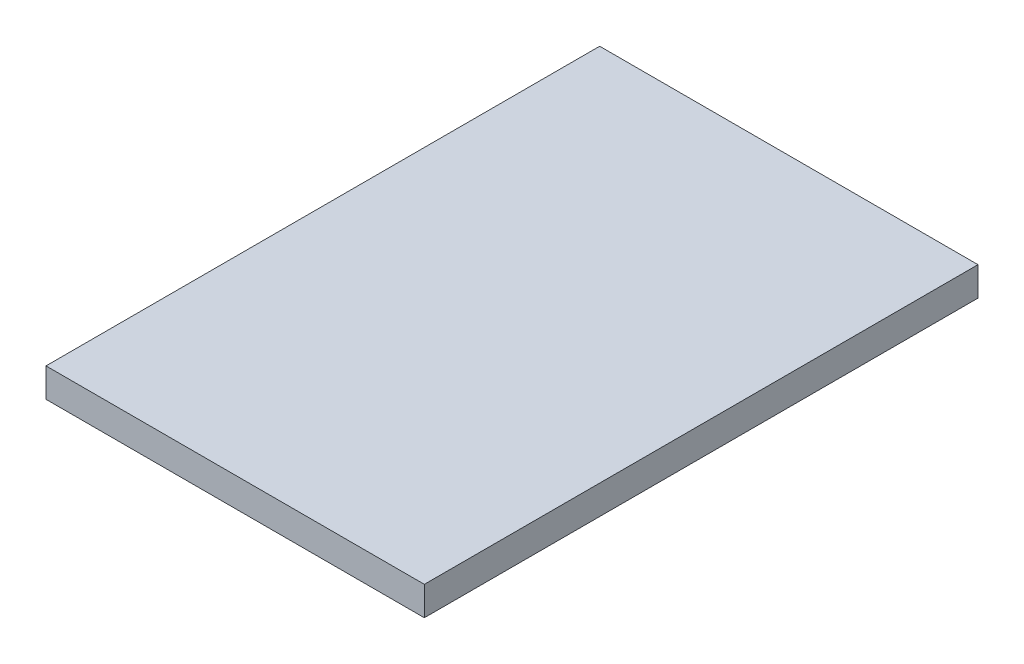
ISO-10303-21;
HEADER;
FILE_DESCRIPTION(('STEP AP214'),'2;1');
FILE_NAME('part.step','',(''),(''),'','','');
FILE_SCHEMA(('AUTOMOTIVE_DESIGN { 1 0 10303 214 1 1 1 1 }'));
ENDSEC;
DATA;
#1=APPLICATION_CONTEXT('core data for automotive mechanical design processes');
#2=APPLICATION_PROTOCOL_DEFINITION('international standard','automotive_design',2000,#1);
#3=PRODUCT_CONTEXT('',#1,'mechanical');
#4=PRODUCT('Part','Part','',(#3));
#5=PRODUCT_RELATED_PRODUCT_CATEGORY('part','',(#4));
#6=PRODUCT_DEFINITION_FORMATION('','',#4);
#7=PRODUCT_DEFINITION_CONTEXT('part definition',#1,'design');
#8=PRODUCT_DEFINITION('design','',#6,#7);
#9=PRODUCT_DEFINITION_SHAPE('','',#8);
#10=(LENGTH_UNIT() NAMED_UNIT(*) SI_UNIT(.MILLI.,.METRE.));
#11=(NAMED_UNIT(*) PLANE_ANGLE_UNIT() SI_UNIT($,.RADIAN.));
#12=(NAMED_UNIT(*) SI_UNIT($,.STERADIAN.) SOLID_ANGLE_UNIT());
#13=UNCERTAINTY_MEASURE_WITH_UNIT(LENGTH_MEASURE(1.E-05),#10,'distance_accuracy_value','');
#14=(GEOMETRIC_REPRESENTATION_CONTEXT(3) GLOBAL_UNCERTAINTY_ASSIGNED_CONTEXT((#13)) GLOBAL_UNIT_ASSIGNED_CONTEXT((#10,
#11,#12)) REPRESENTATION_CONTEXT('',''));
#15=CARTESIAN_POINT('',(0.,0.,0.));
#16=DIRECTION('',(0.,0.,1.));
#17=DIRECTION('',(1.,0.,0.));
#18=AXIS2_PLACEMENT_3D('',#15,#16,#17);
#19=CARTESIAN_POINT('',(0.,1.57,0.));
#20=DIRECTION('',(1.,0.,0.));
#21=DIRECTION('',(0.,0.,-1.));
#22=AXIS2_PLACEMENT_3D('',#19,#20,#21);
#23=PLANE('',#22);
#24=DIRECTION('',(0.,0.,1.));
#25=VECTOR('',#24,1.);
#26=CARTESIAN_POINT('',(0.,0.,0.));
#27=LINE('',#26,#25);
#28=CARTESIAN_POINT('',(0.,0.,-30.));
#29=VERTEX_POINT('',#28);
#30=CARTESIAN_POINT('',(0.,0.,0.));
#31=VERTEX_POINT('',#30);
#32=EDGE_CURVE('E101',#29,#31,#27,.T.);
#33=ORIENTED_EDGE('',*,*,#32,.T.);
#34=DIRECTION('',(0.,-1.,0.));
#35=VECTOR('',#34,1.);
#36=CARTESIAN_POINT('',(0.,1.57,0.));
#37=LINE('',#36,#35);
#38=CARTESIAN_POINT('',(0.,1.57,0.));
#39=VERTEX_POINT('',#38);
#40=EDGE_CURVE('E11',#39,#31,#37,.T.);
#41=ORIENTED_EDGE('',*,*,#40,.F.);
#42=DIRECTION('',(0.,0.,1.));
#43=VECTOR('',#42,1.);
#44=CARTESIAN_POINT('',(0.,1.57,0.));
#45=LINE('',#44,#43);
#46=CARTESIAN_POINT('',(0.,1.57,-30.));
#47=VERTEX_POINT('',#46);
#48=EDGE_CURVE('E89',#47,#39,#45,.T.);
#49=ORIENTED_EDGE('',*,*,#48,.F.);
#50=DIRECTION('',(0.,-1.,0.));
#51=VECTOR('',#50,1.);
#52=CARTESIAN_POINT('',(0.,1.57,-30.));
#53=LINE('',#52,#51);
#54=EDGE_CURVE('E97',#47,#29,#53,.T.);
#55=ORIENTED_EDGE('',*,*,#54,.T.);
#56=EDGE_LOOP('',(#33,#41,#49,#55));
#57=FACE_BOUND('',#56,.T.);
#58=ADVANCED_FACE('F38',(#57),#23,.F.);
#59=CARTESIAN_POINT('',(0.,1.57,0.));
#60=DIRECTION('',(0.,0.,-1.));
#61=DIRECTION('',(-1.,0.,0.));
#62=AXIS2_PLACEMENT_3D('',#59,#60,#61);
#63=PLANE('',#62);
#64=DIRECTION('',(1.,0.,0.));
#65=VECTOR('',#64,1.);
#66=CARTESIAN_POINT('',(0.,0.,0.));
#67=LINE('',#66,#65);
#68=CARTESIAN_POINT('',(20.5,0.,0.));
#69=VERTEX_POINT('',#68);
#70=EDGE_CURVE('E93',#31,#69,#67,.T.);
#71=ORIENTED_EDGE('',*,*,#70,.T.);
#72=DIRECTION('',(0.,-1.,0.));
#73=VECTOR('',#72,1.);
#74=CARTESIAN_POINT('',(20.5,1.57,0.));
#75=LINE('',#74,#73);
#76=CARTESIAN_POINT('',(20.5,1.57,0.));
#77=VERTEX_POINT('',#76);
#78=EDGE_CURVE('E46',#77,#69,#75,.T.);
#79=ORIENTED_EDGE('',*,*,#78,.F.);
#80=DIRECTION('',(1.,0.,0.));
#81=VECTOR('',#80,1.);
#82=CARTESIAN_POINT('',(0.,1.57,0.));
#83=LINE('',#82,#81);
#84=EDGE_CURVE('E84',#39,#77,#83,.T.);
#85=ORIENTED_EDGE('',*,*,#84,.F.);
#86=ORIENTED_EDGE('',*,*,#40,.T.);
#87=EDGE_LOOP('',(#71,#79,#85,#86));
#88=FACE_BOUND('',#87,.T.);
#89=ADVANCED_FACE('F92',(#88),#63,.F.);
#90=CARTESIAN_POINT('',(20.5,1.57,0.));
#91=DIRECTION('',(-1.,0.,0.));
#92=DIRECTION('',(0.,0.,1.));
#93=AXIS2_PLACEMENT_3D('',#90,#91,#92);
#94=PLANE('',#93);
#95=DIRECTION('',(0.,0.,-1.));
#96=VECTOR('',#95,1.);
#97=CARTESIAN_POINT('',(20.5,0.,0.));
#98=LINE('',#97,#96);
#99=CARTESIAN_POINT('',(20.5,0.,-30.));
#100=VERTEX_POINT('',#99);
#101=EDGE_CURVE('E71',#69,#100,#98,.T.);
#102=ORIENTED_EDGE('',*,*,#101,.T.);
#103=DIRECTION('',(0.,-1.,0.));
#104=VECTOR('',#103,1.);
#105=CARTESIAN_POINT('',(20.5,1.57,-30.));
#106=LINE('',#105,#104);
#107=CARTESIAN_POINT('',(20.5,1.57,-30.));
#108=VERTEX_POINT('',#107);
#109=EDGE_CURVE('E94',#108,#100,#106,.T.);
#110=ORIENTED_EDGE('',*,*,#109,.F.);
#111=DIRECTION('',(0.,0.,-1.));
#112=VECTOR('',#111,1.);
#113=CARTESIAN_POINT('',(20.5,1.57,0.));
#114=LINE('',#113,#112);
#115=EDGE_CURVE('E87',#77,#108,#114,.T.);
#116=ORIENTED_EDGE('',*,*,#115,.F.);
#117=ORIENTED_EDGE('',*,*,#78,.T.);
#118=EDGE_LOOP('',(#102,#110,#116,#117));
#119=FACE_BOUND('',#118,.T.);
#120=ADVANCED_FACE('F95',(#119),#94,.F.);
#121=CARTESIAN_POINT('',(0.,1.57,-30.));
#122=DIRECTION('',(0.,0.,1.));
#123=DIRECTION('',(1.,0.,0.));
#124=AXIS2_PLACEMENT_3D('',#121,#122,#123);
#125=PLANE('',#124);
#126=DIRECTION('',(-1.,0.,0.));
#127=VECTOR('',#126,1.);
#128=CARTESIAN_POINT('',(0.,0.,-30.));
#129=LINE('',#128,#127);
#130=EDGE_CURVE('E77',#100,#29,#129,.T.);
#131=ORIENTED_EDGE('',*,*,#130,.T.);
#132=ORIENTED_EDGE('',*,*,#54,.F.);
#133=DIRECTION('',(-1.,0.,0.));
#134=VECTOR('',#133,1.);
#135=CARTESIAN_POINT('',(0.,1.57,-30.));
#136=LINE('',#135,#134);
#137=EDGE_CURVE('E54',#108,#47,#136,.T.);
#138=ORIENTED_EDGE('',*,*,#137,.F.);
#139=ORIENTED_EDGE('',*,*,#109,.T.);
#140=EDGE_LOOP('',(#131,#132,#138,#139));
#141=FACE_BOUND('',#140,.T.);
#142=ADVANCED_FACE('F108',(#141),#125,.F.);
#143=CARTESIAN_POINT('',(0.,1.57,0.));
#144=DIRECTION('',(0.,-1.,0.));
#145=DIRECTION('',(0.,0.,-1.));
#146=AXIS2_PLACEMENT_3D('',#143,#144,#145);
#147=PLANE('',#146);
#148=ORIENTED_EDGE('',*,*,#48,.T.);
#149=ORIENTED_EDGE('',*,*,#84,.T.);
#150=ORIENTED_EDGE('',*,*,#115,.T.);
#151=ORIENTED_EDGE('',*,*,#137,.T.);
#152=EDGE_LOOP('',(#148,#149,#150,#151));
#153=FACE_BOUND('',#152,.T.);
#154=ADVANCED_FACE('F85',(#153),#147,.F.);
#155=CARTESIAN_POINT('',(0.,0.,0.));
#156=DIRECTION('',(0.,-1.,0.));
#157=DIRECTION('',(0.,0.,-1.));
#158=AXIS2_PLACEMENT_3D('',#155,#156,#157);
#159=PLANE('',#158);
#160=ORIENTED_EDGE('',*,*,#32,.F.);
#161=ORIENTED_EDGE('',*,*,#130,.F.);
#162=ORIENTED_EDGE('',*,*,#101,.F.);
#163=ORIENTED_EDGE('',*,*,#70,.F.);
#164=EDGE_LOOP('',(#160,#161,#162,#163));
#165=FACE_BOUND('',#164,.T.);
#166=ADVANCED_FACE('F111',(#165),#159,.T.);
#167=CLOSED_SHELL('',(#58,#89,#120,#142,#154,#166));
#168=MANIFOLD_SOLID_BREP('B2',#167);
#169=ADVANCED_BREP_SHAPE_REPRESENTATION('',(#18,#168),#14);
#170=SHAPE_DEFINITION_REPRESENTATION(#9,#169);
ENDSEC;
END-ISO-10303-21;
